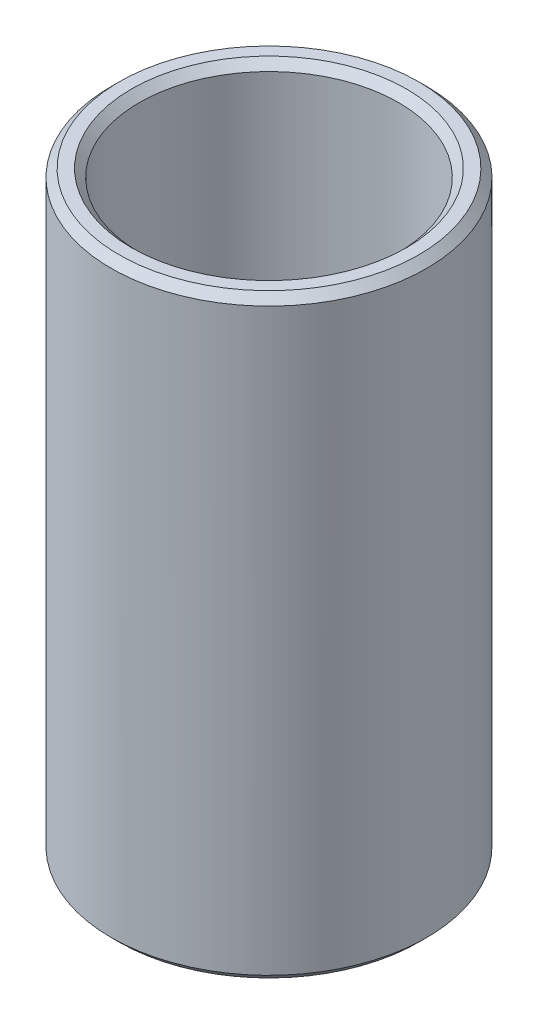
ISO-10303-21;
HEADER;
FILE_DESCRIPTION(('STEP AP214'),'2;1');
FILE_NAME('part.step','',(''),(''),'','','');
FILE_SCHEMA(('AUTOMOTIVE_DESIGN { 1 0 10303 214 1 1 1 1 }'));
ENDSEC;
DATA;
#1=APPLICATION_CONTEXT('core data for automotive mechanical design processes');
#2=APPLICATION_PROTOCOL_DEFINITION('international standard','automotive_design',2000,#1);
#3=PRODUCT_CONTEXT('',#1,'mechanical');
#4=PRODUCT('Part','Part','',(#3));
#5=PRODUCT_RELATED_PRODUCT_CATEGORY('part','',(#4));
#6=PRODUCT_DEFINITION_FORMATION('','',#4);
#7=PRODUCT_DEFINITION_CONTEXT('part definition',#1,'design');
#8=PRODUCT_DEFINITION('design','',#6,#7);
#9=PRODUCT_DEFINITION_SHAPE('','',#8);
#10=(LENGTH_UNIT() NAMED_UNIT(*) SI_UNIT(.MILLI.,.METRE.));
#11=(NAMED_UNIT(*) PLANE_ANGLE_UNIT() SI_UNIT($,.RADIAN.));
#12=(NAMED_UNIT(*) SI_UNIT($,.STERADIAN.) SOLID_ANGLE_UNIT());
#13=UNCERTAINTY_MEASURE_WITH_UNIT(LENGTH_MEASURE(1.E-05),#10,'distance_accuracy_value','');
#14=(GEOMETRIC_REPRESENTATION_CONTEXT(3) GLOBAL_UNCERTAINTY_ASSIGNED_CONTEXT((#13)) GLOBAL_UNIT_ASSIGNED_CONTEXT((#10,
#11,#12)) REPRESENTATION_CONTEXT('',''));
#15=CARTESIAN_POINT('',(0.,0.,0.));
#16=DIRECTION('',(0.,0.,1.));
#17=DIRECTION('',(1.,0.,0.));
#18=AXIS2_PLACEMENT_3D('',#15,#16,#17);
#19=CARTESIAN_POINT('',(0.,198.17366564115,0.));
#20=DIRECTION('',(0.,-1.,0.));
#21=DIRECTION('',(0.,0.,-1.));
#22=AXIS2_PLACEMENT_3D('',#19,#20,#21);
#23=CYLINDRICAL_SURFACE('',#22,52.5);
#24=CARTESIAN_POINT('',(0.,2.61213611857491,0.));
#25=DIRECTION('',(0.,1.,0.));
#26=DIRECTION('',(0.,0.,1.));
#27=AXIS2_PLACEMENT_3D('',#24,#25,#26);
#28=CIRCLE('',#27,52.5);
#29=CARTESIAN_POINT('',(0.,2.61213611857491,52.5));
#30=VERTEX_POINT('',#29);
#31=EDGE_CURVE('E10',#30,#30,#28,.T.);
#32=ORIENTED_EDGE('',*,*,#31,.T.);
#33=EDGE_LOOP('',(#32));
#34=FACE_BOUND('',#33,.T.);
#35=CARTESIAN_POINT('',(0.,195.561529522575,0.));
#36=DIRECTION('',(0.,1.,0.));
#37=DIRECTION('',(0.,0.,1.));
#38=AXIS2_PLACEMENT_3D('',#35,#36,#37);
#39=CIRCLE('',#38,52.5);
#40=CARTESIAN_POINT('',(0.,195.561529522575,-52.5));
#41=VERTEX_POINT('',#40);
#42=EDGE_CURVE('E50',#41,#41,#39,.F.);
#43=ORIENTED_EDGE('',*,*,#42,.T.);
#44=EDGE_LOOP('',(#43));
#45=FACE_BOUND('',#44,.T.);
#46=ADVANCED_FACE('F39',(#34,#45),#23,.T.);
#47=CARTESIAN_POINT('',(0.,198.17366564115,0.));
#48=DIRECTION('',(0.,1.,0.));
#49=DIRECTION('',(0.,0.,1.));
#50=AXIS2_PLACEMENT_3D('',#47,#48,#49);
#51=PLANE('',#50);
#52=CARTESIAN_POINT('',(0.,198.17366564115,0.));
#53=DIRECTION('',(0.,1.,0.));
#54=DIRECTION('',(0.,0.,1.));
#55=AXIS2_PLACEMENT_3D('',#52,#53,#54);
#56=CIRCLE('',#55,45.7813660912682);
#57=CARTESIAN_POINT('',(0.,198.17366564115,45.7813660912682));
#58=VERTEX_POINT('',#57);
#59=EDGE_CURVE('E58',#58,#58,#56,.F.);
#60=ORIENTED_EDGE('',*,*,#59,.T.);
#61=EDGE_LOOP('',(#60));
#62=FACE_BOUND('',#61,.T.);
#63=CARTESIAN_POINT('',(0.,198.17366564115,0.));
#64=DIRECTION('',(0.,1.,0.));
#65=DIRECTION('',(0.,0.,1.));
#66=AXIS2_PLACEMENT_3D('',#63,#64,#65);
#67=CIRCLE('',#66,49.887863881425);
#68=CARTESIAN_POINT('',(0.,198.17366564115,-49.8878638814251));
#69=VERTEX_POINT('',#68);
#70=EDGE_CURVE('E61',#69,#69,#67,.T.);
#71=ORIENTED_EDGE('',*,*,#70,.T.);
#72=EDGE_LOOP('',(#71));
#73=FACE_BOUND('',#72,.T.);
#74=ADVANCED_FACE('F88',(#62,#73),#51,.T.);
#75=CARTESIAN_POINT('',(0.,0.,0.));
#76=DIRECTION('',(0.,1.,0.));
#77=DIRECTION('',(0.,0.,1.));
#78=AXIS2_PLACEMENT_3D('',#75,#76,#77);
#79=PLANE('',#78);
#80=CARTESIAN_POINT('',(0.,0.,0.));
#81=DIRECTION('',(0.,1.,0.));
#82=DIRECTION('',(0.,0.,1.));
#83=AXIS2_PLACEMENT_3D('',#80,#81,#82);
#84=CIRCLE('',#83,45.7813660912683);
#85=CARTESIAN_POINT('',(0.,0.,45.7813660912683));
#86=VERTEX_POINT('',#85);
#87=EDGE_CURVE('E51',#86,#86,#84,.T.);
#88=ORIENTED_EDGE('',*,*,#87,.T.);
#89=EDGE_LOOP('',(#88));
#90=FACE_BOUND('',#89,.T.);
#91=CARTESIAN_POINT('',(0.,0.,0.));
#92=DIRECTION('',(0.,1.,0.));
#93=DIRECTION('',(0.,0.,1.));
#94=AXIS2_PLACEMENT_3D('',#91,#92,#93);
#95=CIRCLE('',#94,49.887863881425);
#96=CARTESIAN_POINT('',(0.,0.,49.887863881425));
#97=VERTEX_POINT('',#96);
#98=EDGE_CURVE('E54',#97,#97,#95,.F.);
#99=ORIENTED_EDGE('',*,*,#98,.T.);
#100=EDGE_LOOP('',(#99));
#101=FACE_BOUND('',#100,.T.);
#102=ADVANCED_FACE('F83',(#90,#101),#79,.F.);
#103=CARTESIAN_POINT('',(0.,198.17366564115,0.));
#104=DIRECTION('',(0.,-1.,0.));
#105=DIRECTION('',(0.,0.,-1.));
#106=AXIS2_PLACEMENT_3D('',#103,#104,#105);
#107=CYLINDRICAL_SURFACE('',#106,43.1692299726933);
#108=CARTESIAN_POINT('',(0.,195.561529522575,0.));
#109=DIRECTION('',(0.,1.,0.));
#110=DIRECTION('',(0.,0.,1.));
#111=AXIS2_PLACEMENT_3D('',#108,#109,#110);
#112=CIRCLE('',#111,43.1692299726933);
#113=CARTESIAN_POINT('',(0.,195.561529522575,43.1692299726933));
#114=VERTEX_POINT('',#113);
#115=EDGE_CURVE('E67',#114,#114,#112,.T.);
#116=ORIENTED_EDGE('',*,*,#115,.T.);
#117=EDGE_LOOP('',(#116));
#118=FACE_BOUND('',#117,.T.);
#119=CARTESIAN_POINT('',(0.,2.61213611857505,0.));
#120=DIRECTION('',(0.,1.,0.));
#121=DIRECTION('',(0.,0.,1.));
#122=AXIS2_PLACEMENT_3D('',#119,#120,#121);
#123=CIRCLE('',#122,43.1692299726933);
#124=CARTESIAN_POINT('',(0.,2.61213611857505,43.1692299726933));
#125=VERTEX_POINT('',#124);
#126=EDGE_CURVE('E69',#125,#125,#123,.F.);
#127=ORIENTED_EDGE('',*,*,#126,.T.);
#128=EDGE_LOOP('',(#127));
#129=FACE_BOUND('',#128,.T.);
#130=ADVANCED_FACE('F71',(#118,#129),#107,.F.);
#131=CARTESIAN_POINT('',(0.,195.561529522575,0.));
#132=DIRECTION('',(0.,1.,0.));
#133=DIRECTION('',(0.,0.,1.));
#134=AXIS2_PLACEMENT_3D('',#131,#132,#133);
#135=CONICAL_SURFACE('',#134,43.1692299726933,0.785398163397446);
#136=ORIENTED_EDGE('',*,*,#59,.F.);
#137=EDGE_LOOP('',(#136));
#138=FACE_BOUND('',#137,.T.);
#139=ORIENTED_EDGE('',*,*,#115,.F.);
#140=EDGE_LOOP('',(#139));
#141=FACE_BOUND('',#140,.T.);
#142=ADVANCED_FACE('F77',(#138,#141),#135,.F.);
#143=CARTESIAN_POINT('',(0.,0.,0.));
#144=DIRECTION('',(0.,-1.,0.));
#145=DIRECTION('',(0.,0.,-1.));
#146=AXIS2_PLACEMENT_3D('',#143,#144,#145);
#147=CONICAL_SURFACE('',#146,45.7813660912683,0.78539816339744);
#148=ORIENTED_EDGE('',*,*,#126,.F.);
#149=EDGE_LOOP('',(#148));
#150=FACE_BOUND('',#149,.T.);
#151=ORIENTED_EDGE('',*,*,#87,.F.);
#152=EDGE_LOOP('',(#151));
#153=FACE_BOUND('',#152,.T.);
#154=ADVANCED_FACE('F73',(#150,#153),#147,.F.);
#155=CARTESIAN_POINT('',(0.,2.61213611857491,0.));
#156=DIRECTION('',(0.,1.,0.));
#157=DIRECTION('',(0.,0.,1.));
#158=AXIS2_PLACEMENT_3D('',#155,#156,#157);
#159=CONICAL_SURFACE('',#158,52.5,0.78539816339746);
#160=ORIENTED_EDGE('',*,*,#98,.F.);
#161=EDGE_LOOP('',(#160));
#162=FACE_BOUND('',#161,.T.);
#163=ORIENTED_EDGE('',*,*,#31,.F.);
#164=EDGE_LOOP('',(#163));
#165=FACE_BOUND('',#164,.T.);
#166=ADVANCED_FACE('F76',(#162,#165),#159,.T.);
#167=CARTESIAN_POINT('',(0.,198.17366564115,0.));
#168=DIRECTION('',(0.,-1.,0.));
#169=DIRECTION('',(0.,0.,-1.));
#170=AXIS2_PLACEMENT_3D('',#167,#168,#169);
#171=CONICAL_SURFACE('',#170,49.887863881425,0.785398163397439);
#172=CARTESIAN_POINT('',(0.,195.561529522575,-52.5));
#173=CARTESIAN_POINT('',(0.,195.58873927381,-52.4727902487649));
#174=CARTESIAN_POINT('',(0.,195.615949025045,-52.4455804975297));
#175=CARTESIAN_POINT('',(0.,195.670368527516,-52.3911609950594));
#176=CARTESIAN_POINT('',(0.,195.697578278751,-52.3639512438242));
#177=CARTESIAN_POINT('',(0.,195.751997781221,-52.3095317413539));
#178=CARTESIAN_POINT('',(0.,195.779207532456,-52.2823219901188));
#179=CARTESIAN_POINT('',(0.,195.833627034927,-52.2279024876485));
#180=CARTESIAN_POINT('',(0.,195.860836786162,-52.2006927364133));
#181=CARTESIAN_POINT('',(0.,195.915256288632,-52.146273233943));
#182=CARTESIAN_POINT('',(0.,195.942466039867,-52.1190634827078));
#183=CARTESIAN_POINT('',(0.,195.996885542337,-52.0646439802375));
#184=CARTESIAN_POINT('',(0.,196.024095293573,-52.0374342290024));
#185=CARTESIAN_POINT('',(0.,196.078514796043,-51.9830147265321));
#186=CARTESIAN_POINT('',(0.,196.105724547278,-51.9558049752969));
#187=CARTESIAN_POINT('',(0.,196.160144049748,-51.9013854728266));
#188=CARTESIAN_POINT('',(0.,196.187353800984,-51.8741757215914));
#189=CARTESIAN_POINT('',(0.,196.241773303454,-51.8197562191211));
#190=CARTESIAN_POINT('',(0.,196.268983054689,-51.792546467886));
#191=CARTESIAN_POINT('',(0.,196.323402557159,-51.7381269654157));
#192=CARTESIAN_POINT('',(0.,196.350612308394,-51.7109172141805));
#193=CARTESIAN_POINT('',(0.,196.405031810865,-51.6564977117102));
#194=CARTESIAN_POINT('',(0.,196.4322415621,-51.629287960475));
#195=CARTESIAN_POINT('',(0.,196.48666106457,-51.5748684580047));
#196=CARTESIAN_POINT('',(0.,196.513870815805,-51.5476587067696));
#197=CARTESIAN_POINT('',(0.,196.568290318276,-51.4932392042993));
#198=CARTESIAN_POINT('',(0.,196.595500069511,-51.4660294530641));
#199=CARTESIAN_POINT('',(0.,196.649919571981,-51.4116099505938));
#200=CARTESIAN_POINT('',(0.,196.677129323216,-51.3844001993586));
#201=CARTESIAN_POINT('',(0.,196.731548825687,-51.3299806968883));
#202=CARTESIAN_POINT('',(0.,196.758758576922,-51.3027709456532));
#203=CARTESIAN_POINT('',(0.,196.813178079392,-51.2483514431828));
#204=CARTESIAN_POINT('',(0.,196.840387830627,-51.2211416919477));
#205=CARTESIAN_POINT('',(0.,196.894807333098,-51.1667221894774));
#206=CARTESIAN_POINT('',(0.,196.922017084333,-51.1395124382422));
#207=CARTESIAN_POINT('',(0.,196.976436586803,-51.0850929357719));
#208=CARTESIAN_POINT('',(0.,197.003646338038,-51.0578831845368));
#209=CARTESIAN_POINT('',(0.,197.058065840509,-51.0034636820664));
#210=CARTESIAN_POINT('',(0.,197.085275591744,-50.9762539308313));
#211=CARTESIAN_POINT('',(0.,197.139695094214,-50.921834428361));
#212=CARTESIAN_POINT('',(0.,197.166904845449,-50.8946246771258));
#213=CARTESIAN_POINT('',(0.,197.221324347919,-50.8402051746555));
#214=CARTESIAN_POINT('',(0.,197.248534099155,-50.8129954234204));
#215=CARTESIAN_POINT('',(0.,197.302953601625,-50.75857592095));
#216=CARTESIAN_POINT('',(0.,197.33016335286,-50.7313661697149));
#217=CARTESIAN_POINT('',(0.,197.38458285533,-50.6769466672446));
#218=CARTESIAN_POINT('',(0.,197.411792606566,-50.6497369160094));
#219=CARTESIAN_POINT('',(0.,197.466212109036,-50.5953174135391));
#220=CARTESIAN_POINT('',(0.,197.493421860271,-50.568107662304));
#221=CARTESIAN_POINT('',(0.,197.547841362741,-50.5136881598336));
#222=CARTESIAN_POINT('',(0.,197.575051113977,-50.4864784085985));
#223=CARTESIAN_POINT('',(0.,197.629470616447,-50.4320589061282));
#224=CARTESIAN_POINT('',(0.,197.656680367682,-50.404849154893));
#225=CARTESIAN_POINT('',(0.,197.711099870152,-50.3504296524227));
#226=CARTESIAN_POINT('',(0.,197.738309621387,-50.3232199011876));
#227=CARTESIAN_POINT('',(0.,197.792729123858,-50.2688003987172));
#228=CARTESIAN_POINT('',(0.,197.819938875093,-50.2415906474821));
#229=CARTESIAN_POINT('',(0.,197.874358377563,-50.1871711450118));
#230=CARTESIAN_POINT('',(0.,197.901568128798,-50.1599613937766));
#231=CARTESIAN_POINT('',(0.,197.955987631269,-50.1055418913063));
#232=CARTESIAN_POINT('',(0.,197.983197382504,-50.0783321400712));
#233=CARTESIAN_POINT('',(0.,198.037616884974,-50.0239126376008));
#234=CARTESIAN_POINT('',(0.,198.064826636209,-49.9967028863657));
#235=CARTESIAN_POINT('',(0.,198.11924613868,-49.9422833838954));
#236=CARTESIAN_POINT('',(0.,198.146455889915,-49.9150736326602));
#237=CARTESIAN_POINT('',(0.,198.17366564115,-49.8878638814251));
#238=B_SPLINE_CURVE_WITH_KNOTS('',3,(#172,#173,#174,#175,#176,#177,#178,#179,#180,#181,#182,
#183,#184,#185,#186,#187,#188,#189,#190,#191,#192,#193,#194,#195,#196,#197,#198,#199,#200,#201,
#202,#203,#204,#205,#206,#207,#208,#209,#210,#211,#212,#213,#214,#215,#216,#217,#218,#219,#220,
#221,#222,#223,#224,#225,#226,#227,#228,#229,#230,#231,#232,#233,#234,#235,#236,#237),
.UNSPECIFIED.,.F.,.F.,(4,2,2,2,2,2,2,2,2,2,2,2,2,2,2,2,2,2,2,2,2,2,2,2,2,2,2,2,2,2,2,2,4),(0.,
0.11544119767665,0.230882395353319,0.346323593029988,0.461764790706662,0.577205988383332,
0.692647186060001,0.80808838373665,0.92352958141332,1.03897077908999,1.15441197676666,
1.26985317444333,1.38529437212,1.50073556979665,1.61617676747332,1.73161796514999,
1.84705916282666,1.96250036050333,2.07794155818,2.19338275585667,2.30882395353332,
2.42426515120999,2.53970634888666,2.65514754656333,2.77058874424,2.88602994191667,
3.00147113959332,3.11691233726999,3.23235353494666,3.34779473262334,3.4632359303,
3.57867712797667,3.69411832565334),.UNSPECIFIED.);
#239=EDGE_CURVE('BSEAM45',#41,#69,#238,.T.);
#240=ORIENTED_EDGE('',*,*,#42,.F.);
#241=ORIENTED_EDGE('',*,*,#70,.F.);
#242=ORIENTED_EDGE('',*,*,#239,.T.);
#243=ORIENTED_EDGE('',*,*,#239,.F.);
#244=EDGE_LOOP('',(#240,#242,#241,#243));
#245=FACE_BOUND('',#244,.T.);
#246=ADVANCED_FACE('F45',(#245),#171,.T.);
#247=CLOSED_SHELL('',(#46,#74,#102,#130,#142,#154,#166,#246));
#248=MANIFOLD_SOLID_BREP('B2',#247);
#249=ADVANCED_BREP_SHAPE_REPRESENTATION('',(#18,#248),#14);
#250=SHAPE_DEFINITION_REPRESENTATION(#9,#249);
ENDSEC;
END-ISO-10303-21;
